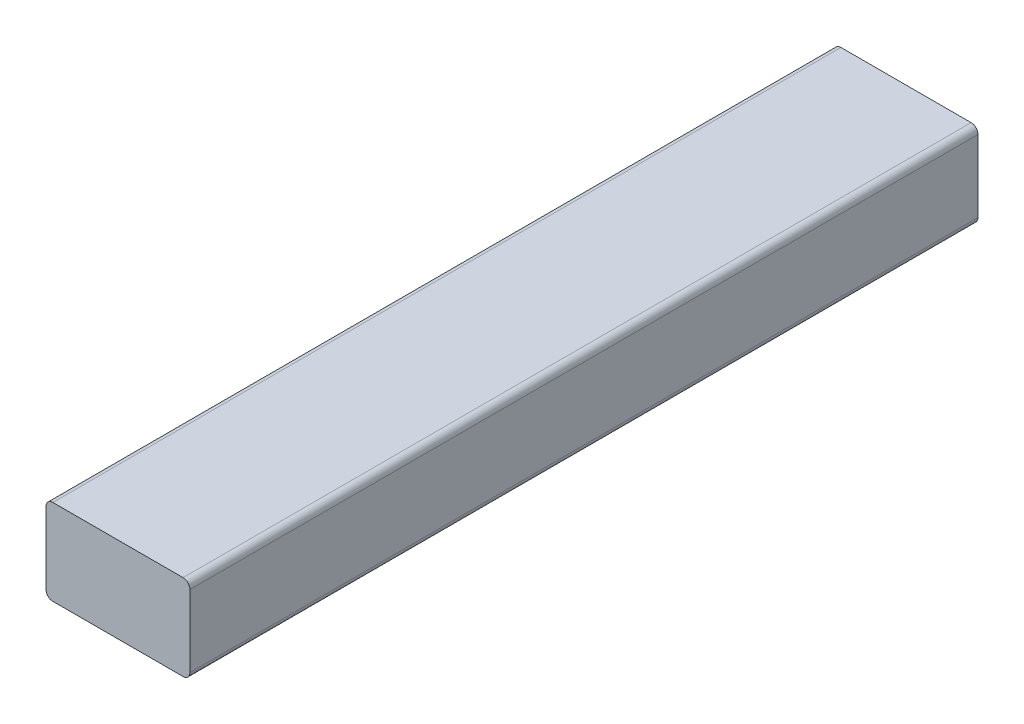
ISO-10303-21;
HEADER;
FILE_DESCRIPTION(('STEP AP214'),'2;1');
FILE_NAME('part.step','',(''),(''),'','','');
FILE_SCHEMA(('AUTOMOTIVE_DESIGN { 1 0 10303 214 1 1 1 1 }'));
ENDSEC;
DATA;
#1=APPLICATION_CONTEXT('core data for automotive mechanical design processes');
#2=APPLICATION_PROTOCOL_DEFINITION('international standard','automotive_design',2000,#1);
#3=PRODUCT_CONTEXT('',#1,'mechanical');
#4=PRODUCT('Part','Part','',(#3));
#5=PRODUCT_RELATED_PRODUCT_CATEGORY('part','',(#4));
#6=PRODUCT_DEFINITION_FORMATION('','',#4);
#7=PRODUCT_DEFINITION_CONTEXT('part definition',#1,'design');
#8=PRODUCT_DEFINITION('design','',#6,#7);
#9=PRODUCT_DEFINITION_SHAPE('','',#8);
#10=(LENGTH_UNIT() NAMED_UNIT(*) SI_UNIT(.MILLI.,.METRE.));
#11=(NAMED_UNIT(*) PLANE_ANGLE_UNIT() SI_UNIT($,.RADIAN.));
#12=(NAMED_UNIT(*) SI_UNIT($,.STERADIAN.) SOLID_ANGLE_UNIT());
#13=UNCERTAINTY_MEASURE_WITH_UNIT(LENGTH_MEASURE(1.E-05),#10,'distance_accuracy_value','');
#14=(GEOMETRIC_REPRESENTATION_CONTEXT(3) GLOBAL_UNCERTAINTY_ASSIGNED_CONTEXT((#13)) GLOBAL_UNIT_ASSIGNED_CONTEXT((#10,
#11,#12)) REPRESENTATION_CONTEXT('',''));
#15=CARTESIAN_POINT('',(0.,0.,0.));
#16=DIRECTION('',(0.,0.,1.));
#17=DIRECTION('',(1.,0.,0.));
#18=AXIS2_PLACEMENT_3D('',#15,#16,#17);
#19=CARTESIAN_POINT('',(-29.3402777777778,15.8854166666667,-230.));
#20=DIRECTION('',(-1.,0.,0.));
#21=DIRECTION('',(0.,0.,1.));
#22=AXIS2_PLACEMENT_3D('',#19,#20,#21);
#23=PLANE('',#22);
#24=DIRECTION('',(0.,-1.,0.));
#25=VECTOR('',#24,1.);
#26=CARTESIAN_POINT('',(-29.3402777777778,15.8854166666667,-230.));
#27=LINE('',#26,#25);
#28=CARTESIAN_POINT('',(-29.3402777777778,13.8854166666667,-230.));
#29=VERTEX_POINT('',#28);
#30=CARTESIAN_POINT('',(-29.3402777777778,-7.11458333333333,-230.));
#31=VERTEX_POINT('',#30);
#32=EDGE_CURVE('E155',#29,#31,#27,.T.);
#33=ORIENTED_EDGE('',*,*,#32,.T.);
#34=DIRECTION('',(0.,0.,1.));
#35=VECTOR('',#34,1.);
#36=CARTESIAN_POINT('',(-29.3402777777778,-7.11458333333333,-230.));
#37=LINE('',#36,#35);
#38=CARTESIAN_POINT('',(-29.3402777777778,-7.11458333333333,0.));
#39=VERTEX_POINT('',#38);
#40=EDGE_CURVE('E11',#31,#39,#37,.T.);
#41=ORIENTED_EDGE('',*,*,#40,.T.);
#42=DIRECTION('',(0.,-1.,0.));
#43=VECTOR('',#42,1.);
#44=CARTESIAN_POINT('',(-29.3402777777778,15.8854166666667,0.));
#45=LINE('',#44,#43);
#46=CARTESIAN_POINT('',(-29.3402777777778,13.8854166666667,0.));
#47=VERTEX_POINT('',#46);
#48=EDGE_CURVE('E105',#47,#39,#45,.T.);
#49=ORIENTED_EDGE('',*,*,#48,.F.);
#50=DIRECTION('',(0.,0.,1.));
#51=VECTOR('',#50,1.);
#52=CARTESIAN_POINT('',(-29.3402777777778,13.8854166666667,-230.));
#53=LINE('',#52,#51);
#54=EDGE_CURVE('E41',#47,#29,#53,.F.);
#55=ORIENTED_EDGE('',*,*,#54,.T.);
#56=EDGE_LOOP('',(#33,#41,#49,#55));
#57=FACE_BOUND('',#56,.T.);
#58=ADVANCED_FACE('F33',(#57),#23,.T.);
#59=CARTESIAN_POINT('',(-29.3402777777778,15.8854166666667,-230.));
#60=DIRECTION('',(0.,1.,0.));
#61=DIRECTION('',(0.,0.,1.));
#62=AXIS2_PLACEMENT_3D('',#59,#60,#61);
#63=PLANE('',#62);
#64=DIRECTION('',(-1.,0.,0.));
#65=VECTOR('',#64,1.);
#66=CARTESIAN_POINT('',(-29.3402777777778,15.8854166666667,0.));
#67=LINE('',#66,#65);
#68=CARTESIAN_POINT('',(10.6597222222222,15.8854166666667,0.));
#69=VERTEX_POINT('',#68);
#70=CARTESIAN_POINT('',(-27.3402777777778,15.8854166666667,0.));
#71=VERTEX_POINT('',#70);
#72=EDGE_CURVE('E131',#69,#71,#67,.T.);
#73=ORIENTED_EDGE('',*,*,#72,.F.);
#74=DIRECTION('',(0.,0.,1.));
#75=VECTOR('',#74,1.);
#76=CARTESIAN_POINT('',(10.6597222222222,15.8854166666667,-230.));
#77=LINE('',#76,#75);
#78=CARTESIAN_POINT('',(10.6597222222222,15.8854166666667,-230.));
#79=VERTEX_POINT('',#78);
#80=EDGE_CURVE('E55',#69,#79,#77,.F.);
#81=ORIENTED_EDGE('',*,*,#80,.T.);
#82=DIRECTION('',(-1.,0.,0.));
#83=VECTOR('',#82,1.);
#84=CARTESIAN_POINT('',(-29.3402777777778,15.8854166666667,-230.));
#85=LINE('',#84,#83);
#86=CARTESIAN_POINT('',(-27.3402777777778,15.8854166666667,-230.));
#87=VERTEX_POINT('',#86);
#88=EDGE_CURVE('E125',#79,#87,#85,.T.);
#89=ORIENTED_EDGE('',*,*,#88,.T.);
#90=DIRECTION('',(0.,0.,1.));
#91=VECTOR('',#90,1.);
#92=CARTESIAN_POINT('',(-27.3402777777778,15.8854166666667,-230.));
#93=LINE('',#92,#91);
#94=EDGE_CURVE('E149',#87,#71,#93,.T.);
#95=ORIENTED_EDGE('',*,*,#94,.T.);
#96=EDGE_LOOP('',(#73,#81,#89,#95));
#97=FACE_BOUND('',#96,.T.);
#98=ADVANCED_FACE('F163',(#97),#63,.T.);
#99=CARTESIAN_POINT('',(12.6597222222222,15.8854166666667,-230.));
#100=DIRECTION('',(1.,0.,0.));
#101=DIRECTION('',(0.,0.,-1.));
#102=AXIS2_PLACEMENT_3D('',#99,#100,#101);
#103=PLANE('',#102);
#104=DIRECTION('',(0.,1.,0.));
#105=VECTOR('',#104,1.);
#106=CARTESIAN_POINT('',(12.6597222222222,15.8854166666667,0.));
#107=LINE('',#106,#105);
#108=CARTESIAN_POINT('',(12.6597222222222,-7.11458333333333,0.));
#109=VERTEX_POINT('',#108);
#110=CARTESIAN_POINT('',(12.6597222222222,13.8854166666667,0.));
#111=VERTEX_POINT('',#110);
#112=EDGE_CURVE('E120',#109,#111,#107,.T.);
#113=ORIENTED_EDGE('',*,*,#112,.F.);
#114=DIRECTION('',(0.,0.,1.));
#115=VECTOR('',#114,1.);
#116=CARTESIAN_POINT('',(12.6597222222222,-7.11458333333333,-230.));
#117=LINE('',#116,#115);
#118=CARTESIAN_POINT('',(12.6597222222222,-7.11458333333333,-230.));
#119=VERTEX_POINT('',#118);
#120=EDGE_CURVE('E141',#109,#119,#117,.F.);
#121=ORIENTED_EDGE('',*,*,#120,.T.);
#122=DIRECTION('',(0.,1.,0.));
#123=VECTOR('',#122,1.);
#124=CARTESIAN_POINT('',(12.6597222222222,15.8854166666667,-230.));
#125=LINE('',#124,#123);
#126=CARTESIAN_POINT('',(12.6597222222222,13.8854166666667,-230.));
#127=VERTEX_POINT('',#126);
#128=EDGE_CURVE('E128',#119,#127,#125,.T.);
#129=ORIENTED_EDGE('',*,*,#128,.T.);
#130=DIRECTION('',(0.,0.,1.));
#131=VECTOR('',#130,1.);
#132=CARTESIAN_POINT('',(12.6597222222222,13.8854166666667,-230.));
#133=LINE('',#132,#131);
#134=EDGE_CURVE('E138',#127,#111,#133,.T.);
#135=ORIENTED_EDGE('',*,*,#134,.T.);
#136=EDGE_LOOP('',(#113,#121,#129,#135));
#137=FACE_BOUND('',#136,.T.);
#138=ADVANCED_FACE('F175',(#137),#103,.T.);
#139=CARTESIAN_POINT('',(-29.3402777777778,-9.11458333333333,-230.));
#140=DIRECTION('',(0.,-1.,0.));
#141=DIRECTION('',(0.,0.,-1.));
#142=AXIS2_PLACEMENT_3D('',#139,#140,#141);
#143=PLANE('',#142);
#144=DIRECTION('',(1.,0.,0.));
#145=VECTOR('',#144,1.);
#146=CARTESIAN_POINT('',(-29.3402777777778,-9.11458333333333,-230.));
#147=LINE('',#146,#145);
#148=CARTESIAN_POINT('',(-27.3402777777778,-9.11458333333333,-230.));
#149=VERTEX_POINT('',#148);
#150=CARTESIAN_POINT('',(10.6597222222222,-9.11458333333333,-230.));
#151=VERTEX_POINT('',#150);
#152=EDGE_CURVE('E159',#149,#151,#147,.T.);
#153=ORIENTED_EDGE('',*,*,#152,.T.);
#154=DIRECTION('',(0.,0.,1.));
#155=VECTOR('',#154,1.);
#156=CARTESIAN_POINT('',(10.6597222222222,-9.11458333333333,-230.));
#157=LINE('',#156,#155);
#158=CARTESIAN_POINT('',(10.6597222222222,-9.11458333333333,0.));
#159=VERTEX_POINT('',#158);
#160=EDGE_CURVE('E119',#151,#159,#157,.T.);
#161=ORIENTED_EDGE('',*,*,#160,.T.);
#162=DIRECTION('',(1.,0.,0.));
#163=VECTOR('',#162,1.);
#164=CARTESIAN_POINT('',(-29.3402777777778,-9.11458333333333,0.));
#165=LINE('',#164,#163);
#166=CARTESIAN_POINT('',(-27.3402777777778,-9.11458333333333,0.));
#167=VERTEX_POINT('',#166);
#168=EDGE_CURVE('E103',#167,#159,#165,.T.);
#169=ORIENTED_EDGE('',*,*,#168,.F.);
#170=DIRECTION('',(0.,0.,1.));
#171=VECTOR('',#170,1.);
#172=CARTESIAN_POINT('',(-27.3402777777778,-9.11458333333333,-230.));
#173=LINE('',#172,#171);
#174=EDGE_CURVE('E116',#167,#149,#173,.F.);
#175=ORIENTED_EDGE('',*,*,#174,.T.);
#176=EDGE_LOOP('',(#153,#161,#169,#175));
#177=FACE_BOUND('',#176,.T.);
#178=ADVANCED_FACE('F115',(#177),#143,.T.);
#179=CARTESIAN_POINT('',(0.,0.,-230.));
#180=DIRECTION('',(0.,0.,1.));
#181=DIRECTION('',(1.,0.,0.));
#182=AXIS2_PLACEMENT_3D('',#179,#180,#181);
#183=PLANE('',#182);
#184=ORIENTED_EDGE('',*,*,#128,.F.);
#185=CARTESIAN_POINT('',(10.6597222222222,-7.11458333333333,-230.));
#186=DIRECTION('',(0.,0.,1.));
#187=DIRECTION('',(1.,0.,0.));
#188=AXIS2_PLACEMENT_3D('',#185,#186,#187);
#189=CIRCLE('',#188,2.);
#190=EDGE_CURVE('E147',#119,#151,#189,.F.);
#191=ORIENTED_EDGE('',*,*,#190,.T.);
#192=ORIENTED_EDGE('',*,*,#152,.F.);
#193=CARTESIAN_POINT('',(-27.3402777777778,-7.11458333333333,-230.));
#194=DIRECTION('',(0.,0.,1.));
#195=DIRECTION('',(1.,0.,0.));
#196=AXIS2_PLACEMENT_3D('',#193,#194,#195);
#197=CIRCLE('',#196,2.);
#198=EDGE_CURVE('E124',#149,#31,#197,.F.);
#199=ORIENTED_EDGE('',*,*,#198,.T.);
#200=ORIENTED_EDGE('',*,*,#32,.F.);
#201=CARTESIAN_POINT('',(-27.3402777777778,13.8854166666667,-230.));
#202=DIRECTION('',(0.,0.,1.));
#203=DIRECTION('',(1.,0.,0.));
#204=AXIS2_PLACEMENT_3D('',#201,#202,#203);
#205=CIRCLE('',#204,2.);
#206=EDGE_CURVE('E48',#29,#87,#205,.F.);
#207=ORIENTED_EDGE('',*,*,#206,.T.);
#208=ORIENTED_EDGE('',*,*,#88,.F.);
#209=CARTESIAN_POINT('',(10.6597222222222,13.8854166666667,-230.));
#210=DIRECTION('',(0.,0.,1.));
#211=DIRECTION('',(1.,0.,0.));
#212=AXIS2_PLACEMENT_3D('',#209,#210,#211);
#213=CIRCLE('',#212,2.);
#214=EDGE_CURVE('E145',#79,#127,#213,.F.);
#215=ORIENTED_EDGE('',*,*,#214,.T.);
#216=EDGE_LOOP('',(#184,#191,#192,#199,#200,#207,#208,#215));
#217=FACE_BOUND('',#216,.T.);
#218=ADVANCED_FACE('F158',(#217),#183,.F.);
#219=CARTESIAN_POINT('',(0.,0.,0.));
#220=DIRECTION('',(0.,0.,1.));
#221=DIRECTION('',(1.,0.,0.));
#222=AXIS2_PLACEMENT_3D('',#219,#220,#221);
#223=PLANE('',#222);
#224=ORIENTED_EDGE('',*,*,#168,.T.);
#225=CARTESIAN_POINT('',(10.6597222222222,-7.11458333333333,0.));
#226=DIRECTION('',(0.,0.,1.));
#227=DIRECTION('',(1.,0.,0.));
#228=AXIS2_PLACEMENT_3D('',#225,#226,#227);
#229=CIRCLE('',#228,2.);
#230=EDGE_CURVE('E136',#159,#109,#229,.T.);
#231=ORIENTED_EDGE('',*,*,#230,.T.);
#232=ORIENTED_EDGE('',*,*,#112,.T.);
#233=CARTESIAN_POINT('',(10.6597222222222,13.8854166666667,0.));
#234=DIRECTION('',(0.,0.,1.));
#235=DIRECTION('',(1.,0.,0.));
#236=AXIS2_PLACEMENT_3D('',#233,#234,#235);
#237=CIRCLE('',#236,2.);
#238=EDGE_CURVE('E109',#111,#69,#237,.T.);
#239=ORIENTED_EDGE('',*,*,#238,.T.);
#240=ORIENTED_EDGE('',*,*,#72,.T.);
#241=CARTESIAN_POINT('',(-27.3402777777778,13.8854166666667,0.));
#242=DIRECTION('',(0.,0.,1.));
#243=DIRECTION('',(1.,0.,0.));
#244=AXIS2_PLACEMENT_3D('',#241,#242,#243);
#245=CIRCLE('',#244,2.);
#246=EDGE_CURVE('E110',#71,#47,#245,.T.);
#247=ORIENTED_EDGE('',*,*,#246,.T.);
#248=ORIENTED_EDGE('',*,*,#48,.T.);
#249=CARTESIAN_POINT('',(-27.3402777777778,-7.11458333333333,0.));
#250=DIRECTION('',(0.,0.,1.));
#251=DIRECTION('',(1.,0.,0.));
#252=AXIS2_PLACEMENT_3D('',#249,#250,#251);
#253=CIRCLE('',#252,2.);
#254=EDGE_CURVE('E100',#39,#167,#253,.T.);
#255=ORIENTED_EDGE('',*,*,#254,.T.);
#256=EDGE_LOOP('',(#224,#231,#232,#239,#240,#247,#248,#255));
#257=FACE_BOUND('',#256,.T.);
#258=ADVANCED_FACE('F102',(#257),#223,.T.);
#259=CARTESIAN_POINT('',(10.6597222222222,-7.11458333333333,-230.));
#260=DIRECTION('',(0.,0.,1.));
#261=DIRECTION('',(1.,0.,0.));
#262=AXIS2_PLACEMENT_3D('',#259,#260,#261);
#263=CYLINDRICAL_SURFACE('',#262,2.);
#264=ORIENTED_EDGE('',*,*,#190,.F.);
#265=ORIENTED_EDGE('',*,*,#120,.F.);
#266=ORIENTED_EDGE('',*,*,#230,.F.);
#267=ORIENTED_EDGE('',*,*,#160,.F.);
#268=EDGE_LOOP('',(#264,#265,#266,#267));
#269=FACE_BOUND('',#268,.T.);
#270=ADVANCED_FACE('F172',(#269),#263,.T.);
#271=CARTESIAN_POINT('',(10.6597222222222,13.8854166666667,-230.));
#272=DIRECTION('',(0.,0.,1.));
#273=DIRECTION('',(1.,0.,0.));
#274=AXIS2_PLACEMENT_3D('',#271,#272,#273);
#275=CYLINDRICAL_SURFACE('',#274,2.);
#276=ORIENTED_EDGE('',*,*,#214,.F.);
#277=ORIENTED_EDGE('',*,*,#80,.F.);
#278=ORIENTED_EDGE('',*,*,#238,.F.);
#279=ORIENTED_EDGE('',*,*,#134,.F.);
#280=EDGE_LOOP('',(#276,#277,#278,#279));
#281=FACE_BOUND('',#280,.T.);
#282=ADVANCED_FACE('F179',(#281),#275,.T.);
#283=CARTESIAN_POINT('',(-27.3402777777778,-7.11458333333333,-230.));
#284=DIRECTION('',(0.,0.,1.));
#285=DIRECTION('',(1.,0.,0.));
#286=AXIS2_PLACEMENT_3D('',#283,#284,#285);
#287=CYLINDRICAL_SURFACE('',#286,2.);
#288=ORIENTED_EDGE('',*,*,#198,.F.);
#289=ORIENTED_EDGE('',*,*,#174,.F.);
#290=ORIENTED_EDGE('',*,*,#254,.F.);
#291=ORIENTED_EDGE('',*,*,#40,.F.);
#292=EDGE_LOOP('',(#288,#289,#290,#291));
#293=FACE_BOUND('',#292,.T.);
#294=ADVANCED_FACE('F123',(#293),#287,.T.);
#295=CARTESIAN_POINT('',(-27.3402777777778,13.8854166666667,-230.));
#296=DIRECTION('',(0.,0.,1.));
#297=DIRECTION('',(1.,0.,0.));
#298=AXIS2_PLACEMENT_3D('',#295,#296,#297);
#299=CYLINDRICAL_SURFACE('',#298,2.);
#300=ORIENTED_EDGE('',*,*,#206,.F.);
#301=ORIENTED_EDGE('',*,*,#54,.F.);
#302=ORIENTED_EDGE('',*,*,#246,.F.);
#303=ORIENTED_EDGE('',*,*,#94,.F.);
#304=EDGE_LOOP('',(#300,#301,#302,#303));
#305=FACE_BOUND('',#304,.T.);
#306=ADVANCED_FACE('F35',(#305),#299,.T.);
#307=CLOSED_SHELL('',(#58,#98,#138,#178,#218,#258,#270,#282,#294,#306));
#308=MANIFOLD_SOLID_BREP('B2',#307);
#309=ADVANCED_BREP_SHAPE_REPRESENTATION('',(#18,#308),#14);
#310=SHAPE_DEFINITION_REPRESENTATION(#9,#309);
ENDSEC;
END-ISO-10303-21;
